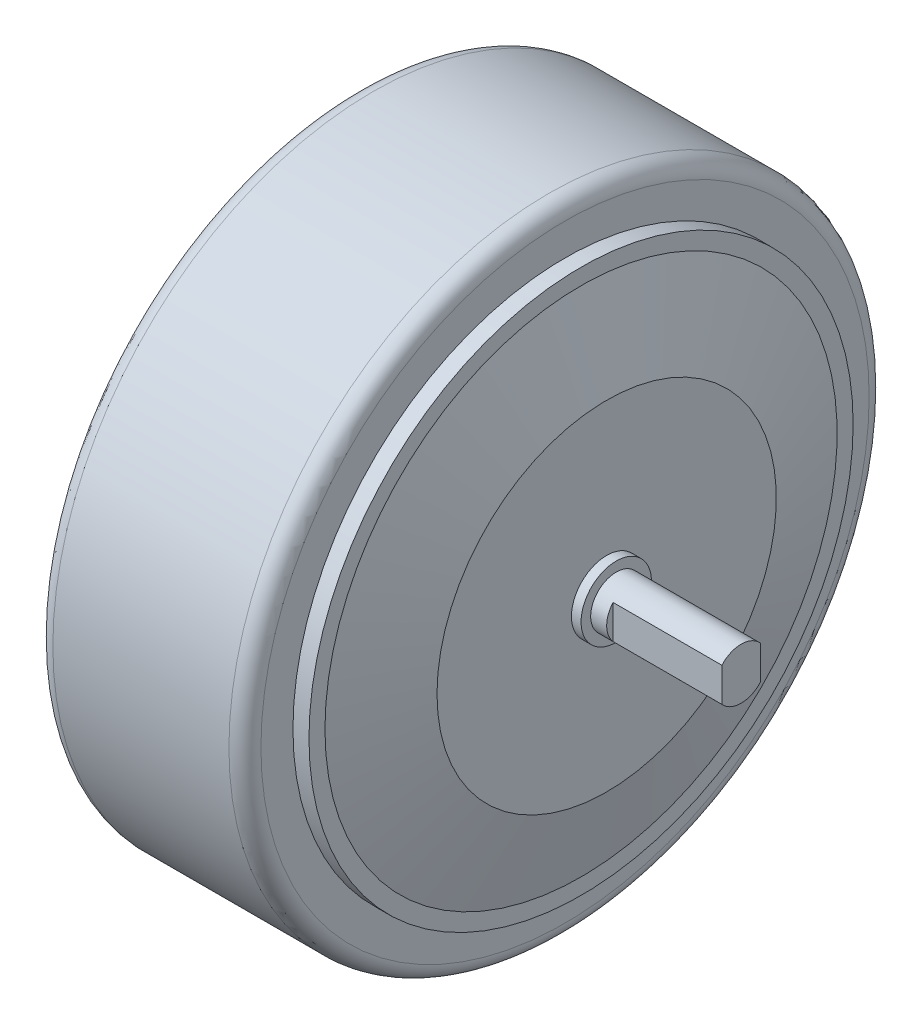
ISO-10303-21;
HEADER;
FILE_DESCRIPTION(('STEP AP214'),'2;1');
FILE_NAME('part.step','',(''),(''),'','','');
FILE_SCHEMA(('AUTOMOTIVE_DESIGN { 1 0 10303 214 1 1 1 1 }'));
ENDSEC;
DATA;
#1=APPLICATION_CONTEXT('core data for automotive mechanical design processes');
#2=APPLICATION_PROTOCOL_DEFINITION('international standard','automotive_design',2000,#1);
#3=PRODUCT_CONTEXT('',#1,'mechanical');
#4=PRODUCT('Part','Part','',(#3));
#5=PRODUCT_RELATED_PRODUCT_CATEGORY('part','',(#4));
#6=PRODUCT_DEFINITION_FORMATION('','',#4);
#7=PRODUCT_DEFINITION_CONTEXT('part definition',#1,'design');
#8=PRODUCT_DEFINITION('design','',#6,#7);
#9=PRODUCT_DEFINITION_SHAPE('','',#8);
#10=(LENGTH_UNIT() NAMED_UNIT(*) SI_UNIT(.MILLI.,.METRE.));
#11=(NAMED_UNIT(*) PLANE_ANGLE_UNIT() SI_UNIT($,.RADIAN.));
#12=(NAMED_UNIT(*) SI_UNIT($,.STERADIAN.) SOLID_ANGLE_UNIT());
#13=UNCERTAINTY_MEASURE_WITH_UNIT(LENGTH_MEASURE(1.E-05),#10,'distance_accuracy_value','');
#14=(GEOMETRIC_REPRESENTATION_CONTEXT(3) GLOBAL_UNCERTAINTY_ASSIGNED_CONTEXT((#13)) GLOBAL_UNIT_ASSIGNED_CONTEXT((#10,
#11,#12)) REPRESENTATION_CONTEXT('',''));
#15=CARTESIAN_POINT('',(0.,0.,0.));
#16=DIRECTION('',(0.,0.,1.));
#17=DIRECTION('',(1.,0.,0.));
#18=AXIS2_PLACEMENT_3D('',#15,#16,#17);
#19=CARTESIAN_POINT('',(-1100.90367486449,0.,0.));
#20=DIRECTION('',(-1.,0.,0.));
#21=DIRECTION('',(0.,0.,1.));
#22=AXIS2_PLACEMENT_3D('',#19,#20,#21);
#23=CYLINDRICAL_SURFACE('',#22,8.);
#24=DIRECTION('',(-1.,0.,0.));
#25=VECTOR('',#24,1.);
#26=CARTESIAN_POINT('',(87.5000000000001,-5.2915026221428,-5.99999999998799));
#27=LINE('',#26,#25);
#28=CARTESIAN_POINT('',(87.5000000000001,-5.2915026221428,-5.99999999998799));
#29=VERTEX_POINT('',#28);
#30=CARTESIAN_POINT('',(53.5000000000001,-5.2915026221428,-5.99999999998799));
#31=VERTEX_POINT('',#30);
#32=EDGE_CURVE('E107',#29,#31,#27,.T.);
#33=ORIENTED_EDGE('',*,*,#32,.F.);
#34=CARTESIAN_POINT('',(87.5000000000001,0.,0.));
#35=DIRECTION('',(-1.,0.,0.));
#36=DIRECTION('',(0.,0.,1.));
#37=AXIS2_PLACEMENT_3D('',#34,#35,#36);
#38=CIRCLE('',#37,8.);
#39=CARTESIAN_POINT('',(87.5000000000001,-5.2915026221428,5.99999999998799));
#40=VERTEX_POINT('',#39);
#41=EDGE_CURVE('E119',#29,#40,#38,.T.);
#42=ORIENTED_EDGE('',*,*,#41,.T.);
#43=DIRECTION('',(-1.,0.,0.));
#44=VECTOR('',#43,1.);
#45=CARTESIAN_POINT('',(87.5000000000001,-5.29150262212852,5.99999999997181));
#46=LINE('',#45,#44);
#47=CARTESIAN_POINT('',(53.5000000000001,-5.29150262212852,5.99999999997181));
#48=VERTEX_POINT('',#47);
#49=EDGE_CURVE('E55',#40,#48,#46,.T.);
#50=ORIENTED_EDGE('',*,*,#49,.T.);
#51=CARTESIAN_POINT('',(53.5000000000001,0.,0.));
#52=DIRECTION('',(1.,0.,0.));
#53=DIRECTION('',(0.,0.,-1.));
#54=AXIS2_PLACEMENT_3D('',#51,#52,#53);
#55=CIRCLE('',#54,8.);
#56=CARTESIAN_POINT('',(53.5000000000001,5.29150262214279,5.999999999988));
#57=VERTEX_POINT('',#56);
#58=EDGE_CURVE('E48',#57,#48,#55,.T.);
#59=ORIENTED_EDGE('',*,*,#58,.F.);
#60=DIRECTION('',(-1.,0.,0.));
#61=VECTOR('',#60,1.);
#62=CARTESIAN_POINT('',(87.5000000000001,5.29150262214279,5.999999999988));
#63=LINE('',#62,#61);
#64=CARTESIAN_POINT('',(87.5000000000001,5.29150262214279,5.999999999988));
#65=VERTEX_POINT('',#64);
#66=EDGE_CURVE('E197',#65,#57,#63,.T.);
#67=ORIENTED_EDGE('',*,*,#66,.F.);
#68=CARTESIAN_POINT('',(87.5000000000001,5.2915026221428,-5.99999999998799));
#69=VERTEX_POINT('',#68);
#70=EDGE_CURVE('E122',#65,#69,#38,.T.);
#71=ORIENTED_EDGE('',*,*,#70,.T.);
#72=DIRECTION('',(-1.,0.,0.));
#73=VECTOR('',#72,1.);
#74=CARTESIAN_POINT('',(87.5000000000001,5.2915026221428,-5.99999999998799));
#75=LINE('',#74,#73);
#76=CARTESIAN_POINT('',(53.5000000000001,5.2915026221428,-5.99999999998799));
#77=VERTEX_POINT('',#76);
#78=EDGE_CURVE('E63',#69,#77,#75,.T.);
#79=ORIENTED_EDGE('',*,*,#78,.T.);
#80=EDGE_CURVE('E12',#31,#77,#55,.T.);
#81=ORIENTED_EDGE('',*,*,#80,.F.);
#82=EDGE_LOOP('',(#33,#42,#50,#59,#67,#71,#79,#81));
#83=FACE_BOUND('',#82,.T.);
#84=CARTESIAN_POINT('',(48.5,0.,0.));
#85=DIRECTION('',(-1.,0.,0.));
#86=DIRECTION('',(0.,0.,1.));
#87=AXIS2_PLACEMENT_3D('',#84,#85,#86);
#88=CIRCLE('',#87,8.);
#89=CARTESIAN_POINT('',(48.5,0.,8.));
#90=VERTEX_POINT('',#89);
#91=EDGE_CURVE('E125',#90,#90,#88,.T.);
#92=ORIENTED_EDGE('',*,*,#91,.F.);
#93=EDGE_LOOP('',(#92));
#94=FACE_BOUND('',#93,.T.);
#95=ADVANCED_FACE('F40',(#83,#94),#23,.T.);
#96=CARTESIAN_POINT('',(87.5,8.,0.));
#97=DIRECTION('',(-1.,0.,0.));
#98=DIRECTION('',(0.,0.,1.));
#99=AXIS2_PLACEMENT_3D('',#96,#97,#98);
#100=PLANE('',#99);
#101=DIRECTION('',(0.,-1.,0.));
#102=VECTOR('',#101,1.);
#103=CARTESIAN_POINT('',(87.5000000000001,-291587.9,-5.99999999997181));
#104=LINE('',#103,#102);
#105=EDGE_CURVE('E104',#69,#29,#104,.T.);
#106=ORIENTED_EDGE('',*,*,#105,.F.);
#107=ORIENTED_EDGE('',*,*,#70,.F.);
#108=DIRECTION('',(0.,1.,0.));
#109=VECTOR('',#108,1.);
#110=CARTESIAN_POINT('',(87.5000000000001,-291587.9,5.99999999997181));
#111=LINE('',#110,#109);
#112=EDGE_CURVE('E113',#40,#65,#111,.T.);
#113=ORIENTED_EDGE('',*,*,#112,.F.);
#114=ORIENTED_EDGE('',*,*,#41,.F.);
#115=EDGE_LOOP('',(#106,#107,#113,#114));
#116=FACE_BOUND('',#115,.T.);
#117=ADVANCED_FACE('F121',(#116),#100,.F.);
#118=CARTESIAN_POINT('',(-48.5000000000002,10.9999999999997,0.));
#119=DIRECTION('',(1.,0.,0.));
#120=DIRECTION('',(0.,0.,-1.));
#121=AXIS2_PLACEMENT_3D('',#118,#119,#120);
#122=PLANE('',#121);
#123=CARTESIAN_POINT('',(-48.5000000000002,0.,0.));
#124=DIRECTION('',(-1.,0.,0.));
#125=DIRECTION('',(0.,0.,1.));
#126=AXIS2_PLACEMENT_3D('',#123,#124,#125);
#127=CIRCLE('',#126,7.99999999999956);
#128=CARTESIAN_POINT('',(-48.5000000000002,0.,7.99999999999956));
#129=VERTEX_POINT('',#128);
#130=EDGE_CURVE('E222',#129,#129,#127,.T.);
#131=ORIENTED_EDGE('',*,*,#130,.F.);
#132=EDGE_LOOP('',(#131));
#133=FACE_BOUND('',#132,.T.);
#134=CARTESIAN_POINT('',(-48.5000000000002,0.,0.));
#135=DIRECTION('',(-1.,0.,0.));
#136=DIRECTION('',(0.,0.,1.));
#137=AXIS2_PLACEMENT_3D('',#134,#135,#136);
#138=CIRCLE('',#137,10.9999999999997);
#139=CARTESIAN_POINT('',(-48.5000000000002,0.,10.9999999999997));
#140=VERTEX_POINT('',#139);
#141=EDGE_CURVE('E166',#140,#140,#138,.T.);
#142=ORIENTED_EDGE('',*,*,#141,.T.);
#143=EDGE_LOOP('',(#142));
#144=FACE_BOUND('',#143,.T.);
#145=ADVANCED_FACE('F255',(#133,#144),#122,.F.);
#146=CARTESIAN_POINT('',(-1100.90367486449,0.,0.));
#147=DIRECTION('',(-1.,0.,0.));
#148=DIRECTION('',(0.,0.,1.));
#149=AXIS2_PLACEMENT_3D('',#146,#147,#148);
#150=CYLINDRICAL_SURFACE('',#149,10.9999999999997);
#151=ORIENTED_EDGE('',*,*,#141,.F.);
#152=EDGE_LOOP('',(#151));
#153=FACE_BOUND('',#152,.T.);
#154=CARTESIAN_POINT('',(-45.5000000000001,0.,0.));
#155=DIRECTION('',(-1.,0.,0.));
#156=DIRECTION('',(0.,0.,1.));
#157=AXIS2_PLACEMENT_3D('',#154,#155,#156);
#158=CIRCLE('',#157,10.9999999999997);
#159=CARTESIAN_POINT('',(-45.5000000000001,0.,10.9999999999997));
#160=VERTEX_POINT('',#159);
#161=EDGE_CURVE('E163',#160,#160,#158,.T.);
#162=ORIENTED_EDGE('',*,*,#161,.T.);
#163=EDGE_LOOP('',(#162));
#164=FACE_BOUND('',#163,.T.);
#165=ADVANCED_FACE('F310',(#153,#164),#150,.T.);
#166=CARTESIAN_POINT('',(-45.5000000000003,52.9999999999996,0.));
#167=DIRECTION('',(1.,0.,0.));
#168=DIRECTION('',(0.,0.,-1.));
#169=AXIS2_PLACEMENT_3D('',#166,#167,#168);
#170=PLANE('',#169);
#171=ORIENTED_EDGE('',*,*,#161,.F.);
#172=EDGE_LOOP('',(#171));
#173=FACE_BOUND('',#172,.T.);
#174=CARTESIAN_POINT('',(-45.5000000000005,0.,0.));
#175=DIRECTION('',(-1.,0.,0.));
#176=DIRECTION('',(0.,0.,1.));
#177=AXIS2_PLACEMENT_3D('',#174,#175,#176);
#178=CIRCLE('',#177,52.9999999999996);
#179=CARTESIAN_POINT('',(-45.5000000000005,0.,52.9999999999996));
#180=VERTEX_POINT('',#179);
#181=EDGE_CURVE('E160',#180,#180,#178,.T.);
#182=ORIENTED_EDGE('',*,*,#181,.T.);
#183=EDGE_LOOP('',(#182));
#184=FACE_BOUND('',#183,.T.);
#185=ADVANCED_FACE('F306',(#173,#184),#170,.F.);
#186=CARTESIAN_POINT('',(-37.5000000000005,0.,0.));
#187=DIRECTION('',(1.,0.,0.));
#188=DIRECTION('',(0.,0.,-1.));
#189=AXIS2_PLACEMENT_3D('',#186,#187,#188);
#190=CONICAL_SURFACE('',#189,79.9999999999996,1.28274087974427);
#191=ORIENTED_EDGE('',*,*,#181,.F.);
#192=EDGE_LOOP('',(#191));
#193=FACE_BOUND('',#192,.T.);
#194=CARTESIAN_POINT('',(-37.5000000000005,0.,0.));
#195=DIRECTION('',(-1.,0.,0.));
#196=DIRECTION('',(0.,0.,1.));
#197=AXIS2_PLACEMENT_3D('',#194,#195,#196);
#198=CIRCLE('',#197,79.9999999999996);
#199=CARTESIAN_POINT('',(-37.5000000000005,0.,79.9999999999996));
#200=VERTEX_POINT('',#199);
#201=EDGE_CURVE('E157',#200,#200,#198,.T.);
#202=ORIENTED_EDGE('',*,*,#201,.T.);
#203=EDGE_LOOP('',(#202));
#204=FACE_BOUND('',#203,.T.);
#205=ADVANCED_FACE('F302',(#193,#204),#190,.T.);
#206=CARTESIAN_POINT('',(-37.5000000000006,84.9999999999996,0.));
#207=DIRECTION('',(1.,0.,0.));
#208=DIRECTION('',(0.,0.,-1.));
#209=AXIS2_PLACEMENT_3D('',#206,#207,#208);
#210=PLANE('',#209);
#211=ORIENTED_EDGE('',*,*,#201,.F.);
#212=EDGE_LOOP('',(#211));
#213=FACE_BOUND('',#212,.T.);
#214=CARTESIAN_POINT('',(-37.5000000000005,0.,0.));
#215=DIRECTION('',(-1.,0.,0.));
#216=DIRECTION('',(0.,0.,1.));
#217=AXIS2_PLACEMENT_3D('',#214,#215,#216);
#218=CIRCLE('',#217,84.9999999999996);
#219=CARTESIAN_POINT('',(-37.5000000000005,0.,84.9999999999996));
#220=VERTEX_POINT('',#219);
#221=EDGE_CURVE('E154',#220,#220,#218,.T.);
#222=ORIENTED_EDGE('',*,*,#221,.T.);
#223=EDGE_LOOP('',(#222));
#224=FACE_BOUND('',#223,.T.);
#225=ADVANCED_FACE('F298',(#213,#224),#210,.F.);
#226=CARTESIAN_POINT('',(-1100.90367486449,0.,0.));
#227=DIRECTION('',(-1.,0.,0.));
#228=DIRECTION('',(0.,0.,1.));
#229=AXIS2_PLACEMENT_3D('',#226,#227,#228);
#230=CYLINDRICAL_SURFACE('',#229,84.9999999999996);
#231=ORIENTED_EDGE('',*,*,#221,.F.);
#232=EDGE_LOOP('',(#231));
#233=FACE_BOUND('',#232,.T.);
#234=CARTESIAN_POINT('',(-32.5000000000006,0.,0.));
#235=DIRECTION('',(-1.,0.,0.));
#236=DIRECTION('',(0.,0.,1.));
#237=AXIS2_PLACEMENT_3D('',#234,#235,#236);
#238=CIRCLE('',#237,84.9999999999996);
#239=CARTESIAN_POINT('',(-32.5000000000006,0.,84.9999999999996));
#240=VERTEX_POINT('',#239);
#241=EDGE_CURVE('E151',#240,#240,#238,.T.);
#242=ORIENTED_EDGE('',*,*,#241,.T.);
#243=EDGE_LOOP('',(#242));
#244=FACE_BOUND('',#243,.T.);
#245=ADVANCED_FACE('F294',(#233,#244),#230,.T.);
#246=CARTESIAN_POINT('',(-32.5000000000006,99.9999999999996,0.));
#247=DIRECTION('',(1.,0.,0.));
#248=DIRECTION('',(0.,0.,-1.));
#249=AXIS2_PLACEMENT_3D('',#246,#247,#248);
#250=PLANE('',#249);
#251=CARTESIAN_POINT('',(-32.5000000000006,0.,0.));
#252=DIRECTION('',(1.,0.,0.));
#253=DIRECTION('',(0.,0.,-1.));
#254=AXIS2_PLACEMENT_3D('',#251,#252,#253);
#255=CIRCLE('',#254,94.9999999999998);
#256=CARTESIAN_POINT('',(-32.5000000000006,0.,-94.9999999999998));
#257=VERTEX_POINT('',#256);
#258=EDGE_CURVE('E178',#257,#257,#255,.F.);
#259=ORIENTED_EDGE('',*,*,#258,.T.);
#260=EDGE_LOOP('',(#259));
#261=FACE_BOUND('',#260,.T.);
#262=ORIENTED_EDGE('',*,*,#241,.F.);
#263=EDGE_LOOP('',(#262));
#264=FACE_BOUND('',#263,.T.);
#265=ADVANCED_FACE('F290',(#261,#264),#250,.F.);
#266=CARTESIAN_POINT('',(-1100.90367486449,0.,0.));
#267=DIRECTION('',(-1.,0.,0.));
#268=DIRECTION('',(0.,0.,1.));
#269=AXIS2_PLACEMENT_3D('',#266,#267,#268);
#270=CYLINDRICAL_SURFACE('',#269,99.9999999999998);
#271=CARTESIAN_POINT('',(27.5000000000001,0.,0.));
#272=DIRECTION('',(-1.,0.,0.));
#273=DIRECTION('',(0.,0.,1.));
#274=AXIS2_PLACEMENT_3D('',#271,#272,#273);
#275=CIRCLE('',#274,99.9999999999998);
#276=CARTESIAN_POINT('',(27.5000000000001,0.,99.9999999999998));
#277=VERTEX_POINT('',#276);
#278=EDGE_CURVE('E172',#277,#277,#275,.T.);
#279=ORIENTED_EDGE('',*,*,#278,.T.);
#280=EDGE_LOOP('',(#279));
#281=FACE_BOUND('',#280,.T.);
#282=CARTESIAN_POINT('',(-27.5000000000007,0.,0.));
#283=DIRECTION('',(1.,0.,0.));
#284=DIRECTION('',(0.,0.,-1.));
#285=AXIS2_PLACEMENT_3D('',#282,#283,#284);
#286=CIRCLE('',#285,99.9999999999998);
#287=CARTESIAN_POINT('',(-27.5000000000007,0.,-99.9999999999998));
#288=VERTEX_POINT('',#287);
#289=EDGE_CURVE('E169',#288,#288,#286,.T.);
#290=ORIENTED_EDGE('',*,*,#289,.T.);
#291=EDGE_LOOP('',(#290));
#292=FACE_BOUND('',#291,.T.);
#293=ADVANCED_FACE('F286',(#281,#292),#270,.T.);
#294=CARTESIAN_POINT('',(32.5,100.,0.));
#295=DIRECTION('',(-1.,0.,0.));
#296=DIRECTION('',(0.,0.,1.));
#297=AXIS2_PLACEMENT_3D('',#294,#295,#296);
#298=PLANE('',#297);
#299=CARTESIAN_POINT('',(32.5,0.,0.));
#300=DIRECTION('',(-1.,0.,0.));
#301=DIRECTION('',(0.,0.,1.));
#302=AXIS2_PLACEMENT_3D('',#299,#300,#301);
#303=CIRCLE('',#302,94.9999999999998);
#304=CARTESIAN_POINT('',(32.5,0.,94.9999999999998));
#305=VERTEX_POINT('',#304);
#306=EDGE_CURVE('E175',#305,#305,#303,.F.);
#307=ORIENTED_EDGE('',*,*,#306,.T.);
#308=EDGE_LOOP('',(#307));
#309=FACE_BOUND('',#308,.T.);
#310=CARTESIAN_POINT('',(32.5,0.,0.));
#311=DIRECTION('',(-1.,0.,0.));
#312=DIRECTION('',(0.,0.,1.));
#313=AXIS2_PLACEMENT_3D('',#310,#311,#312);
#314=CIRCLE('',#313,85.);
#315=CARTESIAN_POINT('',(32.5,0.,85.));
#316=VERTEX_POINT('',#315);
#317=EDGE_CURVE('E148',#316,#316,#314,.T.);
#318=ORIENTED_EDGE('',*,*,#317,.T.);
#319=EDGE_LOOP('',(#318));
#320=FACE_BOUND('',#319,.T.);
#321=ADVANCED_FACE('F282',(#309,#320),#298,.F.);
#322=CARTESIAN_POINT('',(-1100.90367486449,0.,0.));
#323=DIRECTION('',(-1.,0.,0.));
#324=DIRECTION('',(0.,0.,1.));
#325=AXIS2_PLACEMENT_3D('',#322,#323,#324);
#326=CYLINDRICAL_SURFACE('',#325,85.);
#327=ORIENTED_EDGE('',*,*,#317,.F.);
#328=EDGE_LOOP('',(#327));
#329=FACE_BOUND('',#328,.T.);
#330=CARTESIAN_POINT('',(37.5000000000001,0.,0.));
#331=DIRECTION('',(-1.,0.,0.));
#332=DIRECTION('',(0.,0.,1.));
#333=AXIS2_PLACEMENT_3D('',#330,#331,#332);
#334=CIRCLE('',#333,85.);
#335=CARTESIAN_POINT('',(37.5000000000001,0.,85.));
#336=VERTEX_POINT('',#335);
#337=EDGE_CURVE('E145',#336,#336,#334,.T.);
#338=ORIENTED_EDGE('',*,*,#337,.T.);
#339=EDGE_LOOP('',(#338));
#340=FACE_BOUND('',#339,.T.);
#341=ADVANCED_FACE('F278',(#329,#340),#326,.T.);
#342=CARTESIAN_POINT('',(37.5,85.,0.));
#343=DIRECTION('',(-1.,0.,0.));
#344=DIRECTION('',(0.,0.,1.));
#345=AXIS2_PLACEMENT_3D('',#342,#343,#344);
#346=PLANE('',#345);
#347=ORIENTED_EDGE('',*,*,#337,.F.);
#348=EDGE_LOOP('',(#347));
#349=FACE_BOUND('',#348,.T.);
#350=CARTESIAN_POINT('',(37.5000000000001,0.,0.));
#351=DIRECTION('',(-1.,0.,0.));
#352=DIRECTION('',(0.,0.,1.));
#353=AXIS2_PLACEMENT_3D('',#350,#351,#352);
#354=CIRCLE('',#353,80.);
#355=CARTESIAN_POINT('',(37.5000000000001,0.,80.));
#356=VERTEX_POINT('',#355);
#357=EDGE_CURVE('E142',#356,#356,#354,.T.);
#358=ORIENTED_EDGE('',*,*,#357,.T.);
#359=EDGE_LOOP('',(#358));
#360=FACE_BOUND('',#359,.T.);
#361=ADVANCED_FACE('F274',(#349,#360),#346,.F.);
#362=CARTESIAN_POINT('',(45.5000000000001,0.,0.));
#363=DIRECTION('',(-1.,0.,0.));
#364=DIRECTION('',(0.,0.,1.));
#365=AXIS2_PLACEMENT_3D('',#362,#363,#364);
#366=CONICAL_SURFACE('',#365,53.,1.28274087974427);
#367=ORIENTED_EDGE('',*,*,#357,.F.);
#368=EDGE_LOOP('',(#367));
#369=FACE_BOUND('',#368,.T.);
#370=CARTESIAN_POINT('',(45.5000000000001,0.,0.));
#371=DIRECTION('',(-1.,0.,0.));
#372=DIRECTION('',(0.,0.,1.));
#373=AXIS2_PLACEMENT_3D('',#370,#371,#372);
#374=CIRCLE('',#373,53.);
#375=CARTESIAN_POINT('',(45.5000000000001,0.,53.));
#376=VERTEX_POINT('',#375);
#377=EDGE_CURVE('E139',#376,#376,#374,.T.);
#378=ORIENTED_EDGE('',*,*,#377,.T.);
#379=EDGE_LOOP('',(#378));
#380=FACE_BOUND('',#379,.T.);
#381=ADVANCED_FACE('F270',(#369,#380),#366,.T.);
#382=CARTESIAN_POINT('',(45.5000000000001,53.,0.));
#383=DIRECTION('',(-1.,0.,0.));
#384=DIRECTION('',(0.,0.,1.));
#385=AXIS2_PLACEMENT_3D('',#382,#383,#384);
#386=PLANE('',#385);
#387=ORIENTED_EDGE('',*,*,#377,.F.);
#388=EDGE_LOOP('',(#387));
#389=FACE_BOUND('',#388,.T.);
#390=CARTESIAN_POINT('',(45.5000000000001,0.,0.));
#391=DIRECTION('',(-1.,0.,0.));
#392=DIRECTION('',(0.,0.,1.));
#393=AXIS2_PLACEMENT_3D('',#390,#391,#392);
#394=CIRCLE('',#393,11.0000000000002);
#395=CARTESIAN_POINT('',(45.5000000000001,0.,11.0000000000002));
#396=VERTEX_POINT('',#395);
#397=EDGE_CURVE('E136',#396,#396,#394,.T.);
#398=ORIENTED_EDGE('',*,*,#397,.T.);
#399=EDGE_LOOP('',(#398));
#400=FACE_BOUND('',#399,.T.);
#401=ADVANCED_FACE('F266',(#389,#400),#386,.F.);
#402=CARTESIAN_POINT('',(-1100.90367486449,0.,0.));
#403=DIRECTION('',(-1.,0.,0.));
#404=DIRECTION('',(0.,0.,1.));
#405=AXIS2_PLACEMENT_3D('',#402,#403,#404);
#406=CYLINDRICAL_SURFACE('',#405,11.0000000000002);
#407=ORIENTED_EDGE('',*,*,#397,.F.);
#408=EDGE_LOOP('',(#407));
#409=FACE_BOUND('',#408,.T.);
#410=CARTESIAN_POINT('',(48.5000000000002,0.,0.));
#411=DIRECTION('',(-1.,0.,0.));
#412=DIRECTION('',(0.,0.,1.));
#413=AXIS2_PLACEMENT_3D('',#410,#411,#412);
#414=CIRCLE('',#413,11.0000000000002);
#415=CARTESIAN_POINT('',(48.5000000000002,0.,11.0000000000002));
#416=VERTEX_POINT('',#415);
#417=EDGE_CURVE('E133',#416,#416,#414,.T.);
#418=ORIENTED_EDGE('',*,*,#417,.T.);
#419=EDGE_LOOP('',(#418));
#420=FACE_BOUND('',#419,.T.);
#421=ADVANCED_FACE('F262',(#409,#420),#406,.T.);
#422=CARTESIAN_POINT('',(48.5000000000001,11.0000000000002,0.));
#423=DIRECTION('',(-1.,0.,0.));
#424=DIRECTION('',(0.,0.,1.));
#425=AXIS2_PLACEMENT_3D('',#422,#423,#424);
#426=PLANE('',#425);
#427=ORIENTED_EDGE('',*,*,#417,.F.);
#428=EDGE_LOOP('',(#427));
#429=FACE_BOUND('',#428,.T.);
#430=ORIENTED_EDGE('',*,*,#91,.T.);
#431=EDGE_LOOP('',(#430));
#432=FACE_BOUND('',#431,.T.);
#433=ADVANCED_FACE('F259',(#429,#432),#426,.F.);
#434=CARTESIAN_POINT('',(-87.5000000000001,7.99999999999956,0.));
#435=DIRECTION('',(1.,0.,0.));
#436=DIRECTION('',(0.,0.,-1.));
#437=AXIS2_PLACEMENT_3D('',#434,#435,#436);
#438=PLANE('',#437);
#439=CARTESIAN_POINT('',(-87.5000000000001,0.,0.));
#440=DIRECTION('',(-1.,0.,0.));
#441=DIRECTION('',(0.,0.,1.));
#442=AXIS2_PLACEMENT_3D('',#439,#440,#441);
#443=CIRCLE('',#442,7.99999999999956);
#444=CARTESIAN_POINT('',(-87.5000000000001,-5.29150262212852,-5.99999999997181));
#445=VERTEX_POINT('',#444);
#446=CARTESIAN_POINT('',(-87.5000000000001,-5.29150262212852,5.99999999997181));
#447=VERTEX_POINT('',#446);
#448=EDGE_CURVE('E127',#445,#447,#443,.T.);
#449=ORIENTED_EDGE('',*,*,#448,.T.);
#450=DIRECTION('',(0.,1.,0.));
#451=VECTOR('',#450,1.);
#452=CARTESIAN_POINT('',(-87.5000000000001,-291587.9,5.99999999997181));
#453=LINE('',#452,#451);
#454=CARTESIAN_POINT('',(-87.5000000000001,5.2915026221428,5.99999999998799));
#455=VERTEX_POINT('',#454);
#456=EDGE_CURVE('E204',#447,#455,#453,.T.);
#457=ORIENTED_EDGE('',*,*,#456,.T.);
#458=CARTESIAN_POINT('',(-87.5000000000001,5.29150262212852,-5.99999999997181));
#459=VERTEX_POINT('',#458);
#460=EDGE_CURVE('E123',#455,#459,#443,.T.);
#461=ORIENTED_EDGE('',*,*,#460,.T.);
#462=DIRECTION('',(0.,-1.,0.));
#463=VECTOR('',#462,1.);
#464=CARTESIAN_POINT('',(-87.5000000000001,-291587.9,-5.99999999997181));
#465=LINE('',#464,#463);
#466=EDGE_CURVE('E207',#459,#445,#465,.T.);
#467=ORIENTED_EDGE('',*,*,#466,.T.);
#468=EDGE_LOOP('',(#449,#457,#461,#467));
#469=FACE_BOUND('',#468,.T.);
#470=ADVANCED_FACE('F229',(#469),#438,.F.);
#471=CARTESIAN_POINT('',(-1100.90367486449,0.,0.));
#472=DIRECTION('',(-1.,0.,0.));
#473=DIRECTION('',(0.,0.,1.));
#474=AXIS2_PLACEMENT_3D('',#471,#472,#473);
#475=CYLINDRICAL_SURFACE('',#474,7.99999999999956);
#476=DIRECTION('',(1.,0.,0.));
#477=VECTOR('',#476,1.);
#478=CARTESIAN_POINT('',(-87.5000000000001,5.2915026221428,5.99999999998799));
#479=LINE('',#478,#477);
#480=CARTESIAN_POINT('',(-53.5000000000001,5.29150262216048,5.99999999997181));
#481=VERTEX_POINT('',#480);
#482=EDGE_CURVE('E218',#455,#481,#479,.T.);
#483=ORIENTED_EDGE('',*,*,#482,.T.);
#484=CARTESIAN_POINT('',(-53.5000000000001,0.,0.));
#485=DIRECTION('',(1.,0.,0.));
#486=DIRECTION('',(0.,0.,-1.));
#487=AXIS2_PLACEMENT_3D('',#484,#485,#486);
#488=CIRCLE('',#487,7.99999999999956);
#489=CARTESIAN_POINT('',(-53.5000000000002,-5.29150262212852,5.99999999997181));
#490=VERTEX_POINT('',#489);
#491=EDGE_CURVE('E182',#481,#490,#488,.T.);
#492=ORIENTED_EDGE('',*,*,#491,.T.);
#493=DIRECTION('',(1.,0.,0.));
#494=VECTOR('',#493,1.);
#495=CARTESIAN_POINT('',(-87.5000000000001,-5.29150262212852,5.99999999997181));
#496=LINE('',#495,#494);
#497=EDGE_CURVE('E220',#447,#490,#496,.T.);
#498=ORIENTED_EDGE('',*,*,#497,.F.);
#499=ORIENTED_EDGE('',*,*,#448,.F.);
#500=DIRECTION('',(1.,0.,0.));
#501=VECTOR('',#500,1.);
#502=CARTESIAN_POINT('',(-87.5000000000001,-5.29150262212852,-5.99999999997181));
#503=LINE('',#502,#501);
#504=CARTESIAN_POINT('',(-53.5000000000001,-5.29150262216048,-5.99999999997181));
#505=VERTEX_POINT('',#504);
#506=EDGE_CURVE('E211',#445,#505,#503,.T.);
#507=ORIENTED_EDGE('',*,*,#506,.T.);
#508=CARTESIAN_POINT('',(-53.5000000000002,5.29150262212852,-5.99999999997181));
#509=VERTEX_POINT('',#508);
#510=EDGE_CURVE('E180',#505,#509,#488,.T.);
#511=ORIENTED_EDGE('',*,*,#510,.T.);
#512=DIRECTION('',(1.,0.,0.));
#513=VECTOR('',#512,1.);
#514=CARTESIAN_POINT('',(-87.5000000000001,5.29150262212852,-5.99999999997181));
#515=LINE('',#514,#513);
#516=EDGE_CURVE('E216',#459,#509,#515,.T.);
#517=ORIENTED_EDGE('',*,*,#516,.F.);
#518=ORIENTED_EDGE('',*,*,#460,.F.);
#519=EDGE_LOOP('',(#483,#492,#498,#499,#507,#511,#517,#518));
#520=FACE_BOUND('',#519,.T.);
#521=ORIENTED_EDGE('',*,*,#130,.T.);
#522=EDGE_LOOP('',(#521));
#523=FACE_BOUND('',#522,.T.);
#524=ADVANCED_FACE('F231',(#520,#523),#475,.T.);
#525=CARTESIAN_POINT('',(27.5000000000001,0.,0.));
#526=DIRECTION('',(-1.,0.,0.));
#527=DIRECTION('',(0.,0.,1.));
#528=AXIS2_PLACEMENT_3D('',#525,#526,#527);
#529=TOROIDAL_SURFACE('',#528,94.9999999999998,5.);
#530=ORIENTED_EDGE('',*,*,#306,.F.);
#531=EDGE_LOOP('',(#530));
#532=FACE_BOUND('',#531,.T.);
#533=ORIENTED_EDGE('',*,*,#278,.F.);
#534=EDGE_LOOP('',(#533));
#535=FACE_BOUND('',#534,.T.);
#536=ADVANCED_FACE('F317',(#532,#535),#529,.T.);
#537=CARTESIAN_POINT('',(-27.5000000000007,0.,0.));
#538=DIRECTION('',(1.,0.,0.));
#539=DIRECTION('',(0.,0.,-1.));
#540=AXIS2_PLACEMENT_3D('',#537,#538,#539);
#541=TOROIDAL_SURFACE('',#540,94.9999999999998,5.);
#542=ORIENTED_EDGE('',*,*,#289,.F.);
#543=EDGE_LOOP('',(#542));
#544=FACE_BOUND('',#543,.T.);
#545=ORIENTED_EDGE('',*,*,#258,.F.);
#546=EDGE_LOOP('',(#545));
#547=FACE_BOUND('',#546,.T.);
#548=ADVANCED_FACE('F42',(#544,#547),#541,.T.);
#549=CARTESIAN_POINT('',(-87.5000000000001,-291587.9,-5.99999999997181));
#550=DIRECTION('',(0.,0.,1.));
#551=DIRECTION('',(1.,0.,0.));
#552=AXIS2_PLACEMENT_3D('',#549,#550,#551);
#553=PLANE('',#552);
#554=DIRECTION('',(0.,-1.,0.));
#555=VECTOR('',#554,1.);
#556=CARTESIAN_POINT('',(-53.5000000000002,-291587.9,-5.99999999997181));
#557=LINE('',#556,#555);
#558=EDGE_CURVE('E208',#509,#505,#557,.T.);
#559=ORIENTED_EDGE('',*,*,#558,.T.);
#560=ORIENTED_EDGE('',*,*,#506,.F.);
#561=ORIENTED_EDGE('',*,*,#466,.F.);
#562=ORIENTED_EDGE('',*,*,#516,.T.);
#563=EDGE_LOOP('',(#559,#560,#561,#562));
#564=FACE_BOUND('',#563,.T.);
#565=ADVANCED_FACE('F236',(#564),#553,.F.);
#566=CARTESIAN_POINT('',(-53.5000000000002,0.,0.));
#567=DIRECTION('',(1.,0.,0.));
#568=DIRECTION('',(0.,0.,-1.));
#569=AXIS2_PLACEMENT_3D('',#566,#567,#568);
#570=PLANE('',#569);
#571=ORIENTED_EDGE('',*,*,#558,.F.);
#572=ORIENTED_EDGE('',*,*,#510,.F.);
#573=EDGE_LOOP('',(#571,#572));
#574=FACE_BOUND('',#573,.T.);
#575=ADVANCED_FACE('F238',(#574),#570,.F.);
#576=DIRECTION('',(0.,1.,0.));
#577=VECTOR('',#576,1.);
#578=CARTESIAN_POINT('',(-53.5000000000002,-291587.9,5.99999999997181));
#579=LINE('',#578,#577);
#580=EDGE_CURVE('E212',#490,#481,#579,.T.);
#581=ORIENTED_EDGE('',*,*,#580,.F.);
#582=ORIENTED_EDGE('',*,*,#491,.F.);
#583=EDGE_LOOP('',(#581,#582));
#584=FACE_BOUND('',#583,.T.);
#585=ADVANCED_FACE('F240',(#584),#570,.F.);
#586=CARTESIAN_POINT('',(-87.5000000000001,-291587.9,5.99999999997181));
#587=DIRECTION('',(0.,0.,-1.));
#588=DIRECTION('',(-1.,0.,0.));
#589=AXIS2_PLACEMENT_3D('',#586,#587,#588);
#590=PLANE('',#589);
#591=ORIENTED_EDGE('',*,*,#580,.T.);
#592=ORIENTED_EDGE('',*,*,#482,.F.);
#593=ORIENTED_EDGE('',*,*,#456,.F.);
#594=ORIENTED_EDGE('',*,*,#497,.T.);
#595=EDGE_LOOP('',(#591,#592,#593,#594));
#596=FACE_BOUND('',#595,.T.);
#597=ADVANCED_FACE('F233',(#596),#590,.F.);
#598=CARTESIAN_POINT('',(87.5000000000001,-291587.9,5.99999999997181));
#599=DIRECTION('',(0.,0.,1.));
#600=DIRECTION('',(1.,0.,0.));
#601=AXIS2_PLACEMENT_3D('',#598,#599,#600);
#602=PLANE('',#601);
#603=DIRECTION('',(0.,1.,0.));
#604=VECTOR('',#603,1.);
#605=CARTESIAN_POINT('',(53.5000000000001,-291587.9,5.99999999997181));
#606=LINE('',#605,#604);
#607=EDGE_CURVE('E114',#48,#57,#606,.T.);
#608=ORIENTED_EDGE('',*,*,#607,.F.);
#609=ORIENTED_EDGE('',*,*,#49,.F.);
#610=ORIENTED_EDGE('',*,*,#112,.T.);
#611=ORIENTED_EDGE('',*,*,#66,.T.);
#612=EDGE_LOOP('',(#608,#609,#610,#611));
#613=FACE_BOUND('',#612,.T.);
#614=ADVANCED_FACE('F196',(#613),#602,.T.);
#615=CARTESIAN_POINT('',(53.5000000000001,0.,0.));
#616=DIRECTION('',(1.,0.,0.));
#617=DIRECTION('',(0.,0.,-1.));
#618=AXIS2_PLACEMENT_3D('',#615,#616,#617);
#619=PLANE('',#618);
#620=ORIENTED_EDGE('',*,*,#58,.T.);
#621=ORIENTED_EDGE('',*,*,#607,.T.);
#622=EDGE_LOOP('',(#620,#621));
#623=FACE_BOUND('',#622,.T.);
#624=ADVANCED_FACE('F194',(#623),#619,.T.);
#625=ORIENTED_EDGE('',*,*,#80,.T.);
#626=DIRECTION('',(0.,-1.,0.));
#627=VECTOR('',#626,1.);
#628=CARTESIAN_POINT('',(53.5000000000001,-291587.9,-5.99999999997181));
#629=LINE('',#628,#627);
#630=EDGE_CURVE('E198',#77,#31,#629,.T.);
#631=ORIENTED_EDGE('',*,*,#630,.T.);
#632=EDGE_LOOP('',(#625,#631));
#633=FACE_BOUND('',#632,.T.);
#634=ADVANCED_FACE('F445',(#633),#619,.T.);
#635=CARTESIAN_POINT('',(87.5000000000001,-291587.9,-5.99999999997181));
#636=DIRECTION('',(0.,0.,-1.));
#637=DIRECTION('',(-1.,0.,0.));
#638=AXIS2_PLACEMENT_3D('',#635,#636,#637);
#639=PLANE('',#638);
#640=ORIENTED_EDGE('',*,*,#630,.F.);
#641=ORIENTED_EDGE('',*,*,#78,.F.);
#642=ORIENTED_EDGE('',*,*,#105,.T.);
#643=ORIENTED_EDGE('',*,*,#32,.T.);
#644=EDGE_LOOP('',(#640,#641,#642,#643));
#645=FACE_BOUND('',#644,.T.);
#646=ADVANCED_FACE('F106',(#645),#639,.T.);
#647=CLOSED_SHELL('',(#95,#117,#145,#165,#185,#205,#225,#245,#265,#293,#321,#341,#361,#381,#401,
#421,#433,#470,#524,#536,#548,#565,#575,#585,#597,#614,#624,#634,#646));
#648=MANIFOLD_SOLID_BREP('B2',#647);
#649=ADVANCED_BREP_SHAPE_REPRESENTATION('',(#18,#648),#14);
#650=SHAPE_DEFINITION_REPRESENTATION(#9,#649);
ENDSEC;
END-ISO-10303-21;
